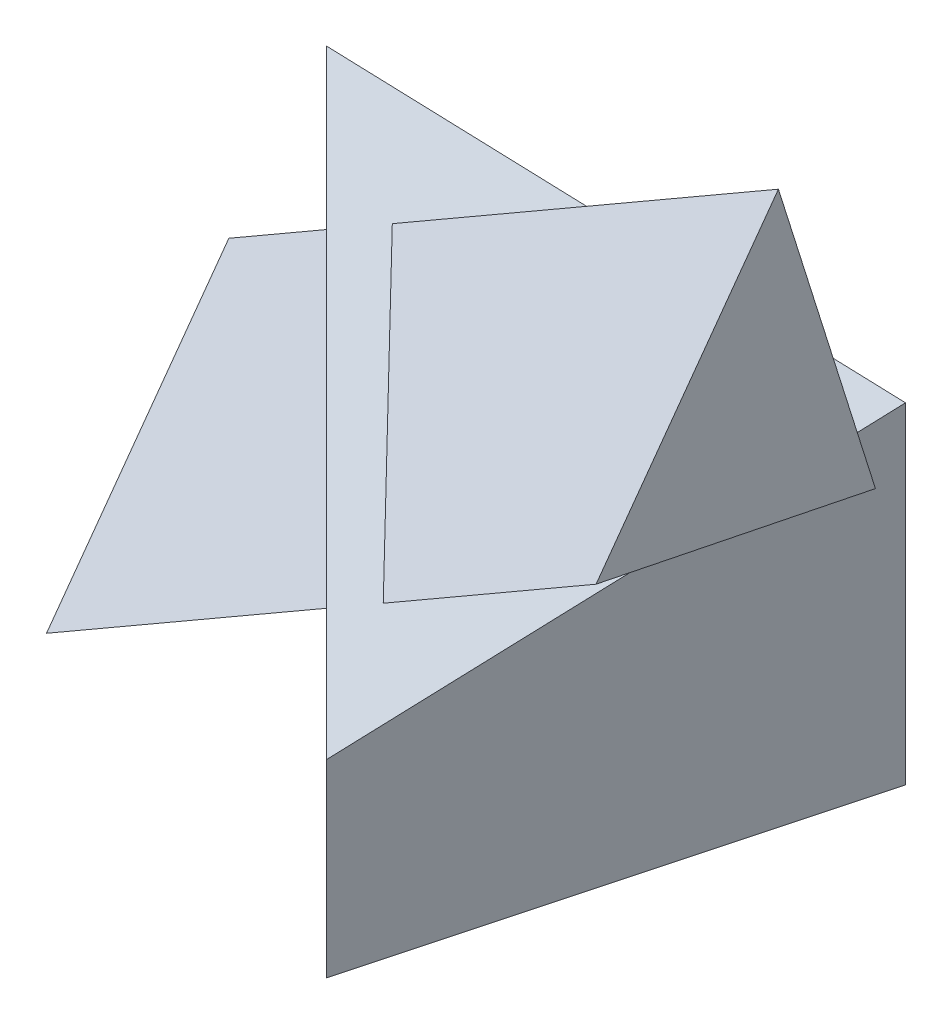
ISO-10303-21;
HEADER;
FILE_DESCRIPTION(('STEP AP214'),'2;1');
FILE_NAME('part.step','',(''),(''),'','','');
FILE_SCHEMA(('AUTOMOTIVE_DESIGN { 1 0 10303 214 1 1 1 1 }'));
ENDSEC;
DATA;
#1=APPLICATION_CONTEXT('core data for automotive mechanical design processes');
#2=APPLICATION_PROTOCOL_DEFINITION('international standard','automotive_design',2000,#1);
#3=PRODUCT_CONTEXT('',#1,'mechanical');
#4=PRODUCT('Part','Part','',(#3));
#5=PRODUCT_RELATED_PRODUCT_CATEGORY('part','',(#4));
#6=PRODUCT_DEFINITION_FORMATION('','',#4);
#7=PRODUCT_DEFINITION_CONTEXT('part definition',#1,'design');
#8=PRODUCT_DEFINITION('design','',#6,#7);
#9=PRODUCT_DEFINITION_SHAPE('','',#8);
#10=(LENGTH_UNIT() NAMED_UNIT(*) SI_UNIT(.MILLI.,.METRE.));
#11=(NAMED_UNIT(*) PLANE_ANGLE_UNIT() SI_UNIT($,.RADIAN.));
#12=(NAMED_UNIT(*) SI_UNIT($,.STERADIAN.) SOLID_ANGLE_UNIT());
#13=UNCERTAINTY_MEASURE_WITH_UNIT(LENGTH_MEASURE(1.E-05),#10,'distance_accuracy_value','');
#14=(GEOMETRIC_REPRESENTATION_CONTEXT(3) GLOBAL_UNCERTAINTY_ASSIGNED_CONTEXT((#13)) GLOBAL_UNIT_ASSIGNED_CONTEXT((#10,
#11,#12)) REPRESENTATION_CONTEXT('',''));
#15=CARTESIAN_POINT('',(0.,0.,0.));
#16=DIRECTION('',(0.,0.,1.));
#17=DIRECTION('',(1.,0.,0.));
#18=AXIS2_PLACEMENT_3D('',#15,#16,#17);
#19=CARTESIAN_POINT('',(-96.5925826289067,217.953554355259,25.8819045102526));
#20=DIRECTION('',(0.707106781186544,0.,-0.707106781186551));
#21=DIRECTION('',(-0.707106781186551,0.,-0.707106781186544));
#22=AXIS2_PLACEMENT_3D('',#19,#20,#21);
#23=PLANE('',#22);
#24=DIRECTION('',(0.618997396453208,0.48340919143962,0.618997396453202));
#25=VECTOR('',#24,1.);
#26=CARTESIAN_POINT('',(-33.704201329841,56.8985103857853,88.7702858093175));
#27=LINE('',#26,#25);
#28=CARTESIAN_POINT('',(-96.5925826289067,7.78550647184086,25.8819045102526));
#29=VERTEX_POINT('',#28);
#30=CARTESIAN_POINT('',(-47.3860219584263,46.2136223953294,75.0884651807324));
#31=VERTEX_POINT('',#30);
#32=EDGE_CURVE('E154',#29,#31,#27,.T.);
#33=ORIENTED_EDGE('',*,*,#32,.F.);
#34=DIRECTION('',(0.,-1.,0.));
#35=VECTOR('',#34,1.);
#36=CARTESIAN_POINT('',(-96.5925826289067,217.953554355259,25.8819045102526));
#37=LINE('',#36,#35);
#38=CARTESIAN_POINT('',(-96.5925826289067,0.,25.8819045102526));
#39=VERTEX_POINT('',#38);
#40=EDGE_CURVE('E176',#29,#39,#37,.T.);
#41=ORIENTED_EDGE('',*,*,#40,.T.);
#42=DIRECTION('',(0.707106781186551,0.,0.707106781186544));
#43=VECTOR('',#42,1.);
#44=CARTESIAN_POINT('',(-96.5925826289067,0.,25.8819045102526));
#45=LINE('',#44,#43);
#46=CARTESIAN_POINT('',(-25.8819045102516,0.,96.5925826289069));
#47=VERTEX_POINT('',#46);
#48=EDGE_CURVE('E171',#39,#47,#45,.T.);
#49=ORIENTED_EDGE('',*,*,#48,.T.);
#50=DIRECTION('',(0.,-1.,0.));
#51=VECTOR('',#50,1.);
#52=CARTESIAN_POINT('',(-25.8819045102516,217.953554355259,96.5925826289069));
#53=LINE('',#52,#51);
#54=CARTESIAN_POINT('',(-25.8819045102516,40.,96.5925826289069));
#55=VERTEX_POINT('',#54);
#56=EDGE_CURVE('E174',#55,#47,#53,.T.);
#57=ORIENTED_EDGE('',*,*,#56,.F.);
#58=DIRECTION('',(-0.606339062590836,0.514495755427527,-0.606339062590829));
#59=VECTOR('',#58,1.);
#60=CARTESIAN_POINT('',(-133.38924063611,131.222999682274,-10.91475349695));
#61=LINE('',#60,#59);
#62=CARTESIAN_POINT('',(-96.5925826289067,100.,25.8819045102526));
#63=VERTEX_POINT('',#62);
#64=EDGE_CURVE('E161',#55,#63,#61,.T.);
#65=ORIENTED_EDGE('',*,*,#64,.T.);
#66=CARTESIAN_POINT('',(-96.5925826289067,37.1239796923197,25.8819045102526));
#67=VERTEX_POINT('',#66);
#68=EDGE_CURVE('E177',#63,#67,#37,.T.);
#69=ORIENTED_EDGE('',*,*,#68,.T.);
#70=DIRECTION('',(-0.249521071530815,-0.935670064565619,-0.249521071530812));
#71=VECTOR('',#70,1.);
#72=CARTESIAN_POINT('',(-54.3744108527432,195.436378999113,68.1000762864157));
#73=LINE('',#72,#71);
#74=CARTESIAN_POINT('',(-85.9532785396194,77.019922279787,36.5212085995398));
#75=VERTEX_POINT('',#74);
#76=EDGE_CURVE('E47',#75,#67,#73,.T.);
#77=ORIENTED_EDGE('',*,*,#76,.F.);
#78=DIRECTION('',(-0.615687131487948,0.491791329976742,-0.615687131487942));
#79=VECTOR('',#78,1.);
#80=CARTESIAN_POINT('',(-136.692611373274,117.548890160097,-14.218124234114));
#81=LINE('',#80,#79);
#82=EDGE_CURVE('E51',#31,#75,#81,.T.);
#83=ORIENTED_EDGE('',*,*,#82,.F.);
#84=EDGE_LOOP('',(#33,#41,#49,#57,#65,#69,#77,#83));
#85=FACE_BOUND('',#84,.T.);
#86=ADVANCED_FACE('F32',(#85),#23,.F.);
#87=CARTESIAN_POINT('',(0.,217.953554355259,0.));
#88=DIRECTION('',(0.258819045102526,0.,0.965925826289067));
#89=DIRECTION('',(0.965925826289067,0.,-0.258819045102526));
#90=AXIS2_PLACEMENT_3D('',#87,#88,#89);
#91=PLANE('',#90);
#92=DIRECTION('',(-0.862225690377328,-0.450766858600848,0.231032677429977));
#93=VECTOR('',#92,1.);
#94=CARTESIAN_POINT('',(62.0577744317478,90.7270423901663,-16.6283305430599));
#95=LINE('',#94,#93);
#96=CARTESIAN_POINT('',(-59.7128129211008,27.0660476603495,16.));
#97=VERTEX_POINT('',#96);
#98=EDGE_CURVE('E151',#97,#29,#95,.T.);
#99=ORIENTED_EDGE('',*,*,#98,.F.);
#100=DIRECTION('',(0.934059821956619,-0.254738852153009,-0.250280574975639));
#101=VECTOR('',#100,1.);
#102=CARTESIAN_POINT('',(-49.2949034867377,24.2248524512627,13.2085295802418));
#103=LINE('',#102,#101);
#104=EDGE_CURVE('E146',#67,#97,#103,.T.);
#105=ORIENTED_EDGE('',*,*,#104,.F.);
#106=ORIENTED_EDGE('',*,*,#68,.F.);
#107=DIRECTION('',(0.925189145993628,-0.287347885566345,-0.247903684515038));
#108=VECTOR('',#107,1.);
#109=CARTESIAN_POINT('',(-39.3336218100022,82.2163485247461,10.5394121993815));
#110=LINE('',#109,#108);
#111=CARTESIAN_POINT('',(0.,70.,0.));
#112=VERTEX_POINT('',#111);
#113=EDGE_CURVE('E157',#63,#112,#110,.T.);
#114=ORIENTED_EDGE('',*,*,#113,.T.);
#115=DIRECTION('',(0.,-1.,0.));
#116=VECTOR('',#115,1.);
#117=CARTESIAN_POINT('',(0.,217.953554355259,0.));
#118=LINE('',#117,#116);
#119=CARTESIAN_POINT('',(0.,0.,0.));
#120=VERTEX_POINT('',#119);
#121=EDGE_CURVE('E179',#112,#120,#118,.T.);
#122=ORIENTED_EDGE('',*,*,#121,.T.);
#123=DIRECTION('',(-0.965925826289067,0.,0.258819045102526));
#124=VECTOR('',#123,1.);
#125=CARTESIAN_POINT('',(0.,0.,0.));
#126=LINE('',#125,#124);
#127=EDGE_CURVE('E168',#120,#39,#126,.T.);
#128=ORIENTED_EDGE('',*,*,#127,.T.);
#129=ORIENTED_EDGE('',*,*,#40,.F.);
#130=EDGE_LOOP('',(#99,#105,#106,#114,#122,#128,#129));
#131=FACE_BOUND('',#130,.T.);
#132=ADVANCED_FACE('F214',(#131),#91,.F.);
#133=CARTESIAN_POINT('',(-25.8819045102516,217.953554355259,96.5925826289069));
#134=DIRECTION('',(-0.96592582628907,0.,-0.258819045102516));
#135=DIRECTION('',(-0.258819045102516,0.,0.96592582628907));
#136=AXIS2_PLACEMENT_3D('',#133,#134,#135);
#137=PLANE('',#136);
#138=DIRECTION('',(0.258530760012024,-0.0471853309453602,-0.964849931684291));
#139=VECTOR('',#138,1.);
#140=CARTESIAN_POINT('',(-27.7720711996214,63.352353976078,103.646780748409));
#141=LINE('',#140,#139);
#142=CARTESIAN_POINT('',(-8.73301160389979,59.8774702606131,32.5920430088433));
#143=VERTEX_POINT('',#142);
#144=CARTESIAN_POINT('',(-4.28718707889787,59.0660476603489,16.));
#145=VERTEX_POINT('',#144);
#146=EDGE_CURVE('E137',#143,#145,#141,.T.);
#147=ORIENTED_EDGE('',*,*,#146,.F.);
#148=DIRECTION('',(-0.247903684515028,-0.287347885566345,0.925189145993631));
#149=VECTOR('',#148,1.);
#150=CARTESIAN_POINT('',(-13.2054543237855,54.6934127449296,49.2834264733986));
#151=LINE('',#150,#149);
#152=EDGE_CURVE('E160',#143,#55,#151,.T.);
#153=ORIENTED_EDGE('',*,*,#152,.T.);
#154=ORIENTED_EDGE('',*,*,#56,.T.);
#155=DIRECTION('',(0.258819045102516,0.,-0.96592582628907));
#156=VECTOR('',#155,1.);
#157=CARTESIAN_POINT('',(-25.8819045102516,0.,96.5925826289069));
#158=LINE('',#157,#156);
#159=EDGE_CURVE('E156',#47,#120,#158,.T.);
#160=ORIENTED_EDGE('',*,*,#159,.T.);
#161=ORIENTED_EDGE('',*,*,#121,.F.);
#162=CARTESIAN_POINT('',(-4.76736339031287,64.47409669359,17.7920423907918));
#163=VERTEX_POINT('',#162);
#164=EDGE_CURVE('E162',#112,#163,#151,.T.);
#165=ORIENTED_EDGE('',*,*,#164,.T.);
#166=DIRECTION('',(-0.0839846756544369,0.94588848550569,0.313435076599558));
#167=VECTOR('',#166,1.);
#168=CARTESIAN_POINT('',(-19.1830476718816,226.832642063538,71.5921085554795));
#169=LINE('',#168,#167);
#170=EDGE_CURVE('E140',#145,#163,#169,.T.);
#171=ORIENTED_EDGE('',*,*,#170,.F.);
#172=EDGE_LOOP('',(#147,#153,#154,#160,#161,#165,#171));
#173=FACE_BOUND('',#172,.T.);
#174=ADVANCED_FACE('F34',(#173),#137,.F.);
#175=CARTESIAN_POINT('',(21.8371211837023,51.4705882352941,21.8371211837021));
#176=DIRECTION('',(-0.363803437554501,-0.857492925712544,-0.363803437554498));
#177=DIRECTION('',(0.920574617898323,-0.390566732942473,0.));
#178=AXIS2_PLACEMENT_3D('',#175,#176,#177);
#179=PLANE('',#178);
#180=DIRECTION('',(0.526415286061124,0.132944881218628,-0.839769376173571));
#181=VECTOR('',#180,1.);
#182=CARTESIAN_POINT('',(3.9044228937827,63.0690231518175,12.4320462048734));
#183=LINE('',#182,#181);
#184=CARTESIAN_POINT('',(-35.3721900127651,53.1498115031559,75.0884651807324));
#185=VERTEX_POINT('',#184);
#186=EDGE_CURVE('E11',#185,#143,#183,.T.);
#187=ORIENTED_EDGE('',*,*,#186,.F.);
#188=DIRECTION('',(0.590753135200462,-0.514373067049269,0.621635810700407));
#189=VECTOR('',#188,1.);
#190=CARTESIAN_POINT('',(-34.4521600724231,52.3487347182984,76.0565913298032));
#191=LINE('',#190,#189);
#192=CARTESIAN_POINT('',(-72.0234371726567,85.0623199427717,36.5212085995398));
#193=VERTEX_POINT('',#192);
#194=EDGE_CURVE('E165',#193,#185,#191,.T.);
#195=ORIENTED_EDGE('',*,*,#194,.F.);
#196=DIRECTION('',(-0.924004434982069,0.282853406700629,0.257312561782971));
#197=VECTOR('',#196,1.);
#198=CARTESIAN_POINT('',(20.3839438358721,56.774855583304,10.7880204948517));
#199=LINE('',#198,#197);
#200=EDGE_CURVE('E40',#163,#193,#199,.T.);
#201=ORIENTED_EDGE('',*,*,#200,.F.);
#202=ORIENTED_EDGE('',*,*,#164,.F.);
#203=ORIENTED_EDGE('',*,*,#113,.F.);
#204=ORIENTED_EDGE('',*,*,#64,.F.);
#205=ORIENTED_EDGE('',*,*,#152,.F.);
#206=EDGE_LOOP('',(#187,#195,#201,#202,#203,#204,#205));
#207=FACE_BOUND('',#206,.T.);
#208=ADVANCED_FACE('F219',(#207),#179,.F.);
#209=CARTESIAN_POINT('',(0.,0.,0.));
#210=DIRECTION('',(0.,1.,0.));
#211=DIRECTION('',(0.,0.,1.));
#212=AXIS2_PLACEMENT_3D('',#209,#210,#211);
#213=PLANE('',#212);
#214=ORIENTED_EDGE('',*,*,#159,.F.);
#215=ORIENTED_EDGE('',*,*,#48,.F.);
#216=ORIENTED_EDGE('',*,*,#127,.F.);
#217=EDGE_LOOP('',(#214,#215,#216));
#218=FACE_BOUND('',#217,.T.);
#219=ADVANCED_FACE('F226',(#218),#213,.F.);
#220=CARTESIAN_POINT('',(9.63965575720976,67.1067141207373,0.));
#221=DIRECTION('',(-1.,0.,0.));
#222=DIRECTION('',(0.,0.,1.));
#223=AXIS2_PLACEMENT_3D('',#220,#221,#222);
#224=PLANE('',#223);
#225=DIRECTION('',(0.,-0.199511483278876,-0.979895488325088));
#226=VECTOR('',#225,1.);
#227=CARTESIAN_POINT('',(9.63965575720976,79.1374127751729,75.0884651807324));
#228=LINE('',#227,#226);
#229=CARTESIAN_POINT('',(9.63965575720976,79.1374127751729,75.0884651807324));
#230=VERTEX_POINT('',#229);
#231=CARTESIAN_POINT('',(9.63965575720976,67.1067141207373,16.));
#232=VERTEX_POINT('',#231);
#233=EDGE_CURVE('E126',#230,#232,#228,.T.);
#234=ORIENTED_EDGE('',*,*,#233,.T.);
#235=DIRECTION('',(0.,0.95374192542295,0.300626578483216));
#236=VECTOR('',#235,1.);
#237=CARTESIAN_POINT('',(9.63965575720976,67.1067141207373,16.));
#238=LINE('',#237,#236);
#239=CARTESIAN_POINT('',(9.63965575720976,132.210528628688,36.5212085995398));
#240=VERTEX_POINT('',#239);
#241=EDGE_CURVE('E114',#232,#240,#238,.T.);
#242=ORIENTED_EDGE('',*,*,#241,.T.);
#243=DIRECTION('',(0.,-0.808963493304009,0.58785888315256));
#244=VECTOR('',#243,1.);
#245=CARTESIAN_POINT('',(9.63965575720976,132.210528628688,36.5212085995398));
#246=LINE('',#245,#244);
#247=EDGE_CURVE('E125',#240,#230,#246,.T.);
#248=ORIENTED_EDGE('',*,*,#247,.T.);
#249=EDGE_LOOP('',(#234,#242,#248));
#250=FACE_BOUND('',#249,.T.);
#251=ADVANCED_FACE('F129',(#250),#224,.F.);
#252=CARTESIAN_POINT('',(9.63965575720976,132.210528628688,36.5212085995398));
#253=DIRECTION('',(0.321393804843273,-0.556670399226423,-0.766044443118974));
#254=DIRECTION('',(0.,0.808963493304009,-0.58785888315256));
#255=AXIS2_PLACEMENT_3D('',#252,#253,#254);
#256=PLANE('',#255);
#257=DIRECTION('',(-0.866025403784438,-0.500000000000001,0.));
#258=VECTOR('',#257,1.);
#259=CARTESIAN_POINT('',(9.63965575720976,132.210528628688,36.5212085995398));
#260=LINE('',#259,#258);
#261=EDGE_CURVE('E122',#240,#193,#260,.T.);
#262=ORIENTED_EDGE('',*,*,#261,.T.);
#263=ORIENTED_EDGE('',*,*,#194,.T.);
#264=DIRECTION('',(-0.866025403784438,-0.500000000000001,0.));
#265=VECTOR('',#264,1.);
#266=CARTESIAN_POINT('',(9.63965575720976,79.1374127751729,75.0884651807324));
#267=LINE('',#266,#265);
#268=EDGE_CURVE('E188',#230,#185,#267,.T.);
#269=ORIENTED_EDGE('',*,*,#268,.F.);
#270=ORIENTED_EDGE('',*,*,#247,.F.);
#271=EDGE_LOOP('',(#262,#263,#269,#270));
#272=FACE_BOUND('',#271,.T.);
#273=ADVANCED_FACE('F186',(#272),#256,.F.);
#274=CARTESIAN_POINT('',(9.63965575720976,67.1067141207373,16.));
#275=DIRECTION('',(0.171010071662831,-0.296198132726018,0.939692620785911));
#276=DIRECTION('',(0.,-0.953741925422949,-0.300626578483216));
#277=AXIS2_PLACEMENT_3D('',#274,#275,#276);
#278=PLANE('',#277);
#279=DIRECTION('',(-0.866025403784438,-0.500000000000001,0.));
#280=VECTOR('',#279,1.);
#281=CARTESIAN_POINT('',(9.63965575720976,67.1067141207373,16.));
#282=LINE('',#281,#280);
#283=EDGE_CURVE('E119',#232,#145,#282,.T.);
#284=ORIENTED_EDGE('',*,*,#283,.T.);
#285=ORIENTED_EDGE('',*,*,#170,.T.);
#286=ORIENTED_EDGE('',*,*,#200,.T.);
#287=ORIENTED_EDGE('',*,*,#261,.F.);
#288=ORIENTED_EDGE('',*,*,#241,.F.);
#289=EDGE_LOOP('',(#284,#285,#286,#287,#288));
#290=FACE_BOUND('',#289,.T.);
#291=ADVANCED_FACE('F116',(#290),#278,.F.);
#292=CARTESIAN_POINT('',(9.63965575720976,79.1374127751729,75.0884651807324));
#293=DIRECTION('',(-0.492403876506104,0.852868531952441,-0.173648177666941));
#294=DIRECTION('',(-0.866025403784438,-0.500000000000001,0.));
#295=AXIS2_PLACEMENT_3D('',#292,#293,#294);
#296=PLANE('',#295);
#297=ORIENTED_EDGE('',*,*,#186,.T.);
#298=ORIENTED_EDGE('',*,*,#146,.T.);
#299=ORIENTED_EDGE('',*,*,#283,.F.);
#300=ORIENTED_EDGE('',*,*,#233,.F.);
#301=ORIENTED_EDGE('',*,*,#268,.T.);
#302=EDGE_LOOP('',(#297,#298,#299,#300,#301));
#303=FACE_BOUND('',#302,.T.);
#304=ADVANCED_FACE('F136',(#303),#296,.F.);
#305=ORIENTED_EDGE('',*,*,#98,.T.);
#306=ORIENTED_EDGE('',*,*,#32,.T.);
#307=CARTESIAN_POINT('',(-106.592582628907,12.0306986544356,75.0884651807324));
#308=VERTEX_POINT('',#307);
#309=EDGE_CURVE('E193',#31,#308,#267,.T.);
#310=ORIENTED_EDGE('',*,*,#309,.T.);
#311=DIRECTION('',(0.,-0.199511483278876,-0.979895488325088));
#312=VECTOR('',#311,1.);
#313=CARTESIAN_POINT('',(-106.592582628907,12.0306986544356,75.0884651807324));
#314=LINE('',#313,#312);
#315=CARTESIAN_POINT('',(-106.592582628907,0.,16.));
#316=VERTEX_POINT('',#315);
#317=EDGE_CURVE('E198',#308,#316,#314,.T.);
#318=ORIENTED_EDGE('',*,*,#317,.T.);
#319=EDGE_CURVE('E138',#97,#316,#282,.T.);
#320=ORIENTED_EDGE('',*,*,#319,.F.);
#321=EDGE_LOOP('',(#305,#306,#310,#318,#320));
#322=FACE_BOUND('',#321,.T.);
#323=ADVANCED_FACE('F204',(#322),#296,.F.);
#324=CARTESIAN_POINT('',(-106.592582628907,65.1038145079504,36.5212085995398));
#325=VERTEX_POINT('',#324);
#326=EDGE_CURVE('E187',#75,#325,#260,.T.);
#327=ORIENTED_EDGE('',*,*,#326,.F.);
#328=ORIENTED_EDGE('',*,*,#76,.T.);
#329=ORIENTED_EDGE('',*,*,#104,.T.);
#330=ORIENTED_EDGE('',*,*,#319,.T.);
#331=DIRECTION('',(0.,0.95374192542295,0.300626578483216));
#332=VECTOR('',#331,1.);
#333=CARTESIAN_POINT('',(-106.592582628907,0.,16.));
#334=LINE('',#333,#332);
#335=EDGE_CURVE('E196',#316,#325,#334,.T.);
#336=ORIENTED_EDGE('',*,*,#335,.T.);
#337=EDGE_LOOP('',(#327,#328,#329,#330,#336));
#338=FACE_BOUND('',#337,.T.);
#339=ADVANCED_FACE('F211',(#338),#278,.F.);
#340=ORIENTED_EDGE('',*,*,#309,.F.);
#341=ORIENTED_EDGE('',*,*,#82,.T.);
#342=ORIENTED_EDGE('',*,*,#326,.T.);
#343=DIRECTION('',(0.,-0.808963493304009,0.58785888315256));
#344=VECTOR('',#343,1.);
#345=CARTESIAN_POINT('',(-106.592582628907,65.1038145079504,36.5212085995398));
#346=LINE('',#345,#344);
#347=EDGE_CURVE('E133',#325,#308,#346,.T.);
#348=ORIENTED_EDGE('',*,*,#347,.T.);
#349=EDGE_LOOP('',(#340,#341,#342,#348));
#350=FACE_BOUND('',#349,.T.);
#351=ADVANCED_FACE('F227',(#350),#256,.F.);
#352=CARTESIAN_POINT('',(-106.592582628907,0.,0.));
#353=DIRECTION('',(-1.,0.,0.));
#354=DIRECTION('',(0.,0.,1.));
#355=AXIS2_PLACEMENT_3D('',#352,#353,#354);
#356=PLANE('',#355);
#357=ORIENTED_EDGE('',*,*,#317,.F.);
#358=ORIENTED_EDGE('',*,*,#347,.F.);
#359=ORIENTED_EDGE('',*,*,#335,.F.);
#360=EDGE_LOOP('',(#357,#358,#359));
#361=FACE_BOUND('',#360,.T.);
#362=ADVANCED_FACE('F209',(#361),#356,.T.);
#363=CLOSED_SHELL('',(#86,#132,#174,#208,#219,#251,#273,#291,#304,#323,#339,#351,#362));
#364=MANIFOLD_SOLID_BREP('B2',#363);
#365=ADVANCED_BREP_SHAPE_REPRESENTATION('',(#18,#364),#14);
#366=SHAPE_DEFINITION_REPRESENTATION(#9,#365);
ENDSEC;
END-ISO-10303-21;
